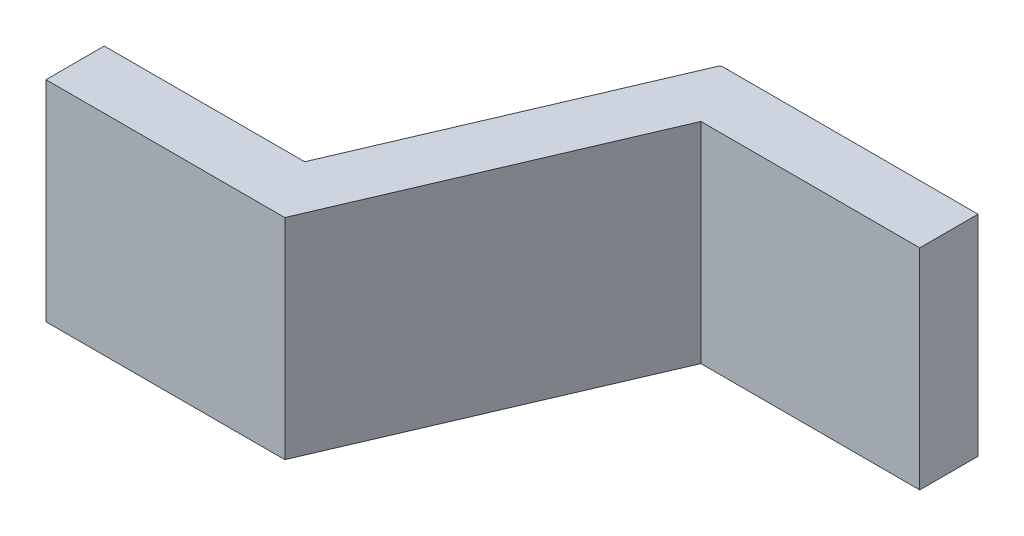
ISO-10303-21;
HEADER;
FILE_DESCRIPTION(('STEP AP214'),'2;1');
FILE_NAME('part.step','',(''),(''),'','','');
FILE_SCHEMA(('AUTOMOTIVE_DESIGN { 1 0 10303 214 1 1 1 1 }'));
ENDSEC;
DATA;
#1=APPLICATION_CONTEXT('core data for automotive mechanical design processes');
#2=APPLICATION_PROTOCOL_DEFINITION('international standard','automotive_design',2000,#1);
#3=PRODUCT_CONTEXT('',#1,'mechanical');
#4=PRODUCT('Part','Part','',(#3));
#5=PRODUCT_RELATED_PRODUCT_CATEGORY('part','',(#4));
#6=PRODUCT_DEFINITION_FORMATION('','',#4);
#7=PRODUCT_DEFINITION_CONTEXT('part definition',#1,'design');
#8=PRODUCT_DEFINITION('design','',#6,#7);
#9=PRODUCT_DEFINITION_SHAPE('','',#8);
#10=(LENGTH_UNIT() NAMED_UNIT(*) SI_UNIT(.MILLI.,.METRE.));
#11=(NAMED_UNIT(*) PLANE_ANGLE_UNIT() SI_UNIT($,.RADIAN.));
#12=(NAMED_UNIT(*) SI_UNIT($,.STERADIAN.) SOLID_ANGLE_UNIT());
#13=UNCERTAINTY_MEASURE_WITH_UNIT(LENGTH_MEASURE(1.E-05),#10,'distance_accuracy_value','');
#14=(GEOMETRIC_REPRESENTATION_CONTEXT(3) GLOBAL_UNCERTAINTY_ASSIGNED_CONTEXT((#13)) GLOBAL_UNIT_ASSIGNED_CONTEXT((#10,
#11,#12)) REPRESENTATION_CONTEXT('',''));
#15=CARTESIAN_POINT('',(0.,0.,0.));
#16=DIRECTION('',(0.,0.,1.));
#17=DIRECTION('',(1.,0.,0.));
#18=AXIS2_PLACEMENT_3D('',#15,#16,#17);
#19=CARTESIAN_POINT('',(11.558086453539,3.42,0.0006058345056003));
#20=DIRECTION('',(-0.919135450912914,0.,-0.393941649073963));
#21=DIRECTION('',(-0.393941649073963,0.,0.919135450912914));
#22=AXIS2_PLACEMENT_3D('',#19,#20,#21);
#23=PLANE('',#22);
#24=DIRECTION('',(0.,1.,0.));
#25=VECTOR('',#24,1.);
#26=CARTESIAN_POINT('',(11.344046008361,3.42,0.5));
#27=LINE('',#26,#25);
#28=CARTESIAN_POINT('',(11.344046008361,3.42,0.5));
#29=VERTEX_POINT('',#28);
#30=CARTESIAN_POINT('',(11.344046008361,3.780000014305,0.5));
#31=VERTEX_POINT('',#30);
#32=EDGE_CURVE('E94',#29,#31,#27,.T.);
#33=ORIENTED_EDGE('',*,*,#32,.T.);
#34=DIRECTION('',(-0.393941649073123,0.,0.919135450913275));
#35=VECTOR('',#34,1.);
#36=CARTESIAN_POINT('',(11.558086453539,3.780000014305,0.000605834505600302));
#37=LINE('',#36,#35);
#38=CARTESIAN_POINT('',(11.558086453539,3.780000014305,0.000605834505577237));
#39=VERTEX_POINT('',#38);
#40=EDGE_CURVE('E121',#39,#31,#37,.T.);
#41=ORIENTED_EDGE('',*,*,#40,.F.);
#42=DIRECTION('',(0.,1.,0.));
#43=VECTOR('',#42,1.);
#44=CARTESIAN_POINT('',(11.558086453539,3.42,0.000605834505554305));
#45=LINE('',#44,#43);
#46=CARTESIAN_POINT('',(11.558086453539,3.42,0.000605834505584969));
#47=VERTEX_POINT('',#46);
#48=EDGE_CURVE('E110',#39,#47,#45,.F.);
#49=ORIENTED_EDGE('',*,*,#48,.T.);
#50=DIRECTION('',(-0.393941649073123,0.,0.919135450913275));
#51=VECTOR('',#50,1.);
#52=CARTESIAN_POINT('',(11.558086453539,3.42,0.000605834505600302));
#53=LINE('',#52,#51);
#54=EDGE_CURVE('E100',#47,#29,#53,.T.);
#55=ORIENTED_EDGE('',*,*,#54,.T.);
#56=EDGE_LOOP('',(#33,#41,#49,#55));
#57=FACE_BOUND('',#56,.T.);
#58=ADVANCED_FACE('F17',(#57),#23,.T.);
#59=CARTESIAN_POINT('',(11.,3.42,0.5));
#60=DIRECTION('',(0.,0.,1.));
#61=DIRECTION('',(1.,0.,0.));
#62=AXIS2_PLACEMENT_3D('',#59,#60,#61);
#63=PLANE('',#62);
#64=DIRECTION('',(1.,0.,0.));
#65=VECTOR('',#64,1.);
#66=CARTESIAN_POINT('',(11.65,3.780000014305,0.5));
#67=LINE('',#66,#65);
#68=CARTESIAN_POINT('',(11.,3.780000014305,0.5));
#69=VERTEX_POINT('',#68);
#70=EDGE_CURVE('E79',#31,#69,#67,.F.);
#71=ORIENTED_EDGE('',*,*,#70,.F.);
#72=ORIENTED_EDGE('',*,*,#32,.F.);
#73=DIRECTION('',(1.,0.,0.));
#74=VECTOR('',#73,1.);
#75=CARTESIAN_POINT('',(11.65,3.42,0.5));
#76=LINE('',#75,#74);
#77=CARTESIAN_POINT('',(11.,3.42,0.5));
#78=VERTEX_POINT('',#77);
#79=EDGE_CURVE('E169',#29,#78,#76,.F.);
#80=ORIENTED_EDGE('',*,*,#79,.T.);
#81=DIRECTION('',(0.,1.,0.));
#82=VECTOR('',#81,1.);
#83=CARTESIAN_POINT('',(11.,3.42,0.5));
#84=LINE('',#83,#82);
#85=EDGE_CURVE('E87',#78,#69,#84,.T.);
#86=ORIENTED_EDGE('',*,*,#85,.T.);
#87=EDGE_LOOP('',(#71,#72,#80,#86));
#88=FACE_BOUND('',#87,.T.);
#89=ADVANCED_FACE('F198',(#88),#63,.F.);
#90=CARTESIAN_POINT('',(11.,3.42,0.5));
#91=DIRECTION('',(1.,0.,0.));
#92=DIRECTION('',(0.,0.,-1.));
#93=AXIS2_PLACEMENT_3D('',#90,#91,#92);
#94=PLANE('',#93);
#95=ORIENTED_EDGE('',*,*,#85,.F.);
#96=DIRECTION('',(0.,0.,1.));
#97=VECTOR('',#96,1.);
#98=CARTESIAN_POINT('',(11.,3.42,0.04));
#99=LINE('',#98,#97);
#100=CARTESIAN_POINT('',(11.,3.42,0.60000000149));
#101=VERTEX_POINT('',#100);
#102=EDGE_CURVE('E153',#78,#101,#99,.T.);
#103=ORIENTED_EDGE('',*,*,#102,.T.);
#104=DIRECTION('',(0.,1.,0.));
#105=VECTOR('',#104,1.);
#106=CARTESIAN_POINT('',(11.,3.42,0.60000000149));
#107=LINE('',#106,#105);
#108=CARTESIAN_POINT('',(11.,3.780000014305,0.60000000149));
#109=VERTEX_POINT('',#108);
#110=EDGE_CURVE('E117',#109,#101,#107,.F.);
#111=ORIENTED_EDGE('',*,*,#110,.F.);
#112=DIRECTION('',(0.,0.,1.));
#113=VECTOR('',#112,1.);
#114=CARTESIAN_POINT('',(11.,3.780000014305,0.04));
#115=LINE('',#114,#113);
#116=EDGE_CURVE('E71',#69,#109,#115,.T.);
#117=ORIENTED_EDGE('',*,*,#116,.F.);
#118=EDGE_LOOP('',(#95,#103,#111,#117));
#119=FACE_BOUND('',#118,.T.);
#120=ADVANCED_FACE('F202',(#119),#94,.F.);
#121=CARTESIAN_POINT('',(11.999999997616,3.42,0.));
#122=DIRECTION('',(1.,0.,0.));
#123=DIRECTION('',(0.,0.,-1.));
#124=AXIS2_PLACEMENT_3D('',#121,#122,#123);
#125=PLANE('',#124);
#126=DIRECTION('',(0.,0.,1.));
#127=VECTOR('',#126,1.);
#128=CARTESIAN_POINT('',(11.999999997616,3.42,0.04));
#129=LINE('',#128,#127);
#130=CARTESIAN_POINT('',(11.999999997616,3.42,0.10000000149));
#131=VERTEX_POINT('',#130);
#132=CARTESIAN_POINT('',(11.999999997616,3.42,0.));
#133=VERTEX_POINT('',#132);
#134=EDGE_CURVE('E179',#131,#133,#129,.F.);
#135=ORIENTED_EDGE('',*,*,#134,.T.);
#136=DIRECTION('',(0.,1.,0.));
#137=VECTOR('',#136,1.);
#138=CARTESIAN_POINT('',(11.999999997616,3.42,0.));
#139=LINE('',#138,#137);
#140=CARTESIAN_POINT('',(11.999999997616,3.780000014305,0.));
#141=VERTEX_POINT('',#140);
#142=EDGE_CURVE('E174',#133,#141,#139,.T.);
#143=ORIENTED_EDGE('',*,*,#142,.T.);
#144=DIRECTION('',(0.,0.,1.));
#145=VECTOR('',#144,1.);
#146=CARTESIAN_POINT('',(11.999999997616,3.780000014305,0.04));
#147=LINE('',#146,#145);
#148=CARTESIAN_POINT('',(11.999999997616,3.780000014305,0.10000000149));
#149=VERTEX_POINT('',#148);
#150=EDGE_CURVE('E155',#149,#141,#147,.F.);
#151=ORIENTED_EDGE('',*,*,#150,.F.);
#152=DIRECTION('',(0.,1.,0.));
#153=VECTOR('',#152,1.);
#154=CARTESIAN_POINT('',(11.999999997616,3.42,0.10000000149));
#155=LINE('',#154,#153);
#156=EDGE_CURVE('E125',#131,#149,#155,.T.);
#157=ORIENTED_EDGE('',*,*,#156,.F.);
#158=EDGE_LOOP('',(#135,#143,#151,#157));
#159=FACE_BOUND('',#158,.T.);
#160=ADVANCED_FACE('F228',(#159),#125,.T.);
#161=CARTESIAN_POINT('',(11.56,3.42,0.));
#162=DIRECTION('',(0.,0.,1.));
#163=DIRECTION('',(1.,0.,0.));
#164=AXIS2_PLACEMENT_3D('',#161,#162,#163);
#165=PLANE('',#164);
#166=DIRECTION('',(1.,0.,0.));
#167=VECTOR('',#166,1.);
#168=CARTESIAN_POINT('',(11.65,3.42,0.));
#169=LINE('',#168,#167);
#170=CARTESIAN_POINT('',(11.56,3.42,0.));
#171=VERTEX_POINT('',#170);
#172=EDGE_CURVE('E150',#133,#171,#169,.F.);
#173=ORIENTED_EDGE('',*,*,#172,.T.);
#174=DIRECTION('',(0.,1.,0.));
#175=VECTOR('',#174,1.);
#176=CARTESIAN_POINT('',(11.56,3.42,0.));
#177=LINE('',#176,#175);
#178=CARTESIAN_POINT('',(11.56,3.780000014305,0.));
#179=VERTEX_POINT('',#178);
#180=EDGE_CURVE('E164',#171,#179,#177,.T.);
#181=ORIENTED_EDGE('',*,*,#180,.T.);
#182=DIRECTION('',(1.,0.,0.));
#183=VECTOR('',#182,1.);
#184=CARTESIAN_POINT('',(11.65,3.780000014305,0.));
#185=LINE('',#184,#183);
#186=EDGE_CURVE('E154',#141,#179,#185,.F.);
#187=ORIENTED_EDGE('',*,*,#186,.F.);
#188=ORIENTED_EDGE('',*,*,#142,.F.);
#189=EDGE_LOOP('',(#173,#181,#187,#188));
#190=FACE_BOUND('',#189,.T.);
#191=ADVANCED_FACE('F232',(#190),#165,.F.);
#192=CARTESIAN_POINT('',(11.56,3.42,0.));
#193=DIRECTION('',(1.,0.,0.));
#194=DIRECTION('',(0.,0.,-1.));
#195=AXIS2_PLACEMENT_3D('',#192,#193,#194);
#196=PLANE('',#195);
#197=DIRECTION('',(0.,1.,0.));
#198=VECTOR('',#197,1.);
#199=CARTESIAN_POINT('',(11.56,3.42,0.00142598092431268));
#200=LINE('',#199,#198);
#201=CARTESIAN_POINT('',(11.56,3.42,0.00142598092431734));
#202=VERTEX_POINT('',#201);
#203=CARTESIAN_POINT('',(11.56,3.780000014305,0.00142598092431734));
#204=VERTEX_POINT('',#203);
#205=EDGE_CURVE('E118',#202,#204,#200,.T.);
#206=ORIENTED_EDGE('',*,*,#205,.T.);
#207=DIRECTION('',(0.,0.,1.));
#208=VECTOR('',#207,1.);
#209=CARTESIAN_POINT('',(11.56,3.780000014305,0.04));
#210=LINE('',#209,#208);
#211=EDGE_CURVE('E123',#179,#204,#210,.T.);
#212=ORIENTED_EDGE('',*,*,#211,.F.);
#213=ORIENTED_EDGE('',*,*,#180,.F.);
#214=DIRECTION('',(0.,0.,-1.));
#215=VECTOR('',#214,1.);
#216=CARTESIAN_POINT('',(11.56,3.42,0.));
#217=LINE('',#216,#215);
#218=EDGE_CURVE('E147',#171,#202,#217,.F.);
#219=ORIENTED_EDGE('',*,*,#218,.T.);
#220=EDGE_LOOP('',(#206,#212,#213,#219));
#221=FACE_BOUND('',#220,.T.);
#222=ADVANCED_FACE('F234',(#221),#196,.F.);
#223=CARTESIAN_POINT('',(11.65,3.42,0.04));
#224=DIRECTION('',(-0.393941649073963,0.,0.919135450912914));
#225=DIRECTION('',(0.919135450912914,0.,0.393941649073963));
#226=AXIS2_PLACEMENT_3D('',#223,#224,#225);
#227=PLANE('',#226);
#228=DIRECTION('',(-0.919135450920459,0.,-0.393941649056361));
#229=VECTOR('',#228,1.);
#230=CARTESIAN_POINT('',(11.56,3.780000014305,0.001425980924322));
#231=LINE('',#230,#229);
#232=EDGE_CURVE('E113',#204,#39,#231,.T.);
#233=ORIENTED_EDGE('',*,*,#232,.F.);
#234=ORIENTED_EDGE('',*,*,#205,.F.);
#235=DIRECTION('',(-0.919135450920459,0.,-0.393941649056361));
#236=VECTOR('',#235,1.);
#237=CARTESIAN_POINT('',(11.56,3.42,0.001425980924322));
#238=LINE('',#237,#236);
#239=EDGE_CURVE('E114',#202,#47,#238,.T.);
#240=ORIENTED_EDGE('',*,*,#239,.T.);
#241=ORIENTED_EDGE('',*,*,#48,.F.);
#242=EDGE_LOOP('',(#233,#234,#240,#241));
#243=FACE_BOUND('',#242,.T.);
#244=ADVANCED_FACE('F112',(#243),#227,.F.);
#245=CARTESIAN_POINT('',(11.,3.42,0.60000000149));
#246=DIRECTION('',(0.,0.,1.));
#247=DIRECTION('',(1.,0.,0.));
#248=AXIS2_PLACEMENT_3D('',#245,#246,#247);
#249=PLANE('',#248);
#250=DIRECTION('',(0.,1.,0.));
#251=VECTOR('',#250,1.);
#252=CARTESIAN_POINT('',(11.4099838806682,3.42,0.60000000149));
#253=LINE('',#252,#251);
#254=CARTESIAN_POINT('',(11.4099838806682,3.42,0.60000000149));
#255=VERTEX_POINT('',#254);
#256=CARTESIAN_POINT('',(11.4099838806682,3.780000014305,0.60000000149));
#257=VERTEX_POINT('',#256);
#258=EDGE_CURVE('E144',#255,#257,#253,.T.);
#259=ORIENTED_EDGE('',*,*,#258,.T.);
#260=DIRECTION('',(1.,0.,0.));
#261=VECTOR('',#260,1.);
#262=CARTESIAN_POINT('',(11.65,3.780000014305,0.60000000149));
#263=LINE('',#262,#261);
#264=EDGE_CURVE('E20',#109,#257,#263,.T.);
#265=ORIENTED_EDGE('',*,*,#264,.F.);
#266=ORIENTED_EDGE('',*,*,#110,.T.);
#267=DIRECTION('',(1.,0.,0.));
#268=VECTOR('',#267,1.);
#269=CARTESIAN_POINT('',(11.,3.42,0.60000000149));
#270=LINE('',#269,#268);
#271=EDGE_CURVE('E151',#101,#255,#270,.T.);
#272=ORIENTED_EDGE('',*,*,#271,.T.);
#273=EDGE_LOOP('',(#259,#265,#266,#272));
#274=FACE_BOUND('',#273,.T.);
#275=ADVANCED_FACE('F205',(#274),#249,.T.);
#276=CARTESIAN_POINT('',(11.65,3.780000014305,0.04));
#277=DIRECTION('',(0.,1.,0.));
#278=DIRECTION('',(0.,0.,1.));
#279=AXIS2_PLACEMENT_3D('',#276,#277,#278);
#280=PLANE('',#279);
#281=ORIENTED_EDGE('',*,*,#211,.T.);
#282=ORIENTED_EDGE('',*,*,#232,.T.);
#283=ORIENTED_EDGE('',*,*,#40,.T.);
#284=ORIENTED_EDGE('',*,*,#70,.T.);
#285=ORIENTED_EDGE('',*,*,#116,.T.);
#286=ORIENTED_EDGE('',*,*,#264,.T.);
#287=DIRECTION('',(-0.393941649073964,0.,0.919135450912914));
#288=VECTOR('',#287,1.);
#289=CARTESIAN_POINT('',(11.6242839866442,3.780000014305,0.100000001490094));
#290=LINE('',#289,#288);
#291=CARTESIAN_POINT('',(11.6242839866442,3.780000014305,0.100000001490047));
#292=VERTEX_POINT('',#291);
#293=EDGE_CURVE('E141',#257,#292,#290,.F.);
#294=ORIENTED_EDGE('',*,*,#293,.T.);
#295=DIRECTION('',(1.,0.,0.));
#296=VECTOR('',#295,1.);
#297=CARTESIAN_POINT('',(11.56,3.780000014305,0.10000000149));
#298=LINE('',#297,#296);
#299=EDGE_CURVE('E170',#149,#292,#298,.F.);
#300=ORIENTED_EDGE('',*,*,#299,.F.);
#301=ORIENTED_EDGE('',*,*,#150,.T.);
#302=ORIENTED_EDGE('',*,*,#186,.T.);
#303=EDGE_LOOP('',(#281,#282,#283,#284,#285,#286,#294,#300,#301,#302));
#304=FACE_BOUND('',#303,.T.);
#305=ADVANCED_FACE('F120',(#304),#280,.T.);
#306=CARTESIAN_POINT('',(11.56,3.42,0.10000000149));
#307=DIRECTION('',(0.,0.,1.));
#308=DIRECTION('',(1.,0.,0.));
#309=AXIS2_PLACEMENT_3D('',#306,#307,#308);
#310=PLANE('',#309);
#311=ORIENTED_EDGE('',*,*,#299,.T.);
#312=DIRECTION('',(0.,1.,0.));
#313=VECTOR('',#312,1.);
#314=CARTESIAN_POINT('',(11.6242839866442,3.42,0.100000001490094));
#315=LINE('',#314,#313);
#316=CARTESIAN_POINT('',(11.6242839866442,3.42,0.100000001490047));
#317=VERTEX_POINT('',#316);
#318=EDGE_CURVE('E26',#292,#317,#315,.F.);
#319=ORIENTED_EDGE('',*,*,#318,.T.);
#320=DIRECTION('',(1.,0.,0.));
#321=VECTOR('',#320,1.);
#322=CARTESIAN_POINT('',(11.65,3.42,0.10000000149));
#323=LINE('',#322,#321);
#324=EDGE_CURVE('E34',#317,#131,#323,.T.);
#325=ORIENTED_EDGE('',*,*,#324,.T.);
#326=ORIENTED_EDGE('',*,*,#156,.T.);
#327=EDGE_LOOP('',(#311,#319,#325,#326));
#328=FACE_BOUND('',#327,.T.);
#329=ADVANCED_FACE('F223',(#328),#310,.T.);
#330=CARTESIAN_POINT('',(11.65,3.42,0.04));
#331=DIRECTION('',(0.,1.,0.));
#332=DIRECTION('',(0.,0.,1.));
#333=AXIS2_PLACEMENT_3D('',#330,#331,#332);
#334=PLANE('',#333);
#335=ORIENTED_EDGE('',*,*,#218,.F.);
#336=ORIENTED_EDGE('',*,*,#172,.F.);
#337=ORIENTED_EDGE('',*,*,#134,.F.);
#338=ORIENTED_EDGE('',*,*,#324,.F.);
#339=DIRECTION('',(0.393941649073964,0.,-0.919135450912914));
#340=VECTOR('',#339,1.);
#341=CARTESIAN_POINT('',(11.4098164411035,3.42,0.600390667570103));
#342=LINE('',#341,#340);
#343=EDGE_CURVE('E11',#317,#255,#342,.F.);
#344=ORIENTED_EDGE('',*,*,#343,.T.);
#345=ORIENTED_EDGE('',*,*,#271,.F.);
#346=ORIENTED_EDGE('',*,*,#102,.F.);
#347=ORIENTED_EDGE('',*,*,#79,.F.);
#348=ORIENTED_EDGE('',*,*,#54,.F.);
#349=ORIENTED_EDGE('',*,*,#239,.F.);
#350=EDGE_LOOP('',(#335,#336,#337,#338,#344,#345,#346,#347,#348,#349));
#351=FACE_BOUND('',#350,.T.);
#352=ADVANCED_FACE('F200',(#351),#334,.F.);
#353=CARTESIAN_POINT('',(11.65,3.42,0.04));
#354=DIRECTION('',(-0.919135450912914,0.,-0.393941649073963));
#355=DIRECTION('',(-0.393941649073963,0.,0.919135450912914));
#356=AXIS2_PLACEMENT_3D('',#353,#354,#355);
#357=PLANE('',#356);
#358=ORIENTED_EDGE('',*,*,#318,.F.);
#359=ORIENTED_EDGE('',*,*,#293,.F.);
#360=ORIENTED_EDGE('',*,*,#258,.F.);
#361=ORIENTED_EDGE('',*,*,#343,.F.);
#362=EDGE_LOOP('',(#358,#359,#360,#361));
#363=FACE_BOUND('',#362,.T.);
#364=ADVANCED_FACE('F210',(#363),#357,.F.);
#365=CLOSED_SHELL('',(#58,#89,#120,#160,#191,#222,#244,#275,#305,#329,#352,#364));
#366=MANIFOLD_SOLID_BREP('B1',#365);
#367=ADVANCED_BREP_SHAPE_REPRESENTATION('',(#18,#366),#14);
#368=SHAPE_DEFINITION_REPRESENTATION(#9,#367);
ENDSEC;
END-ISO-10303-21;
